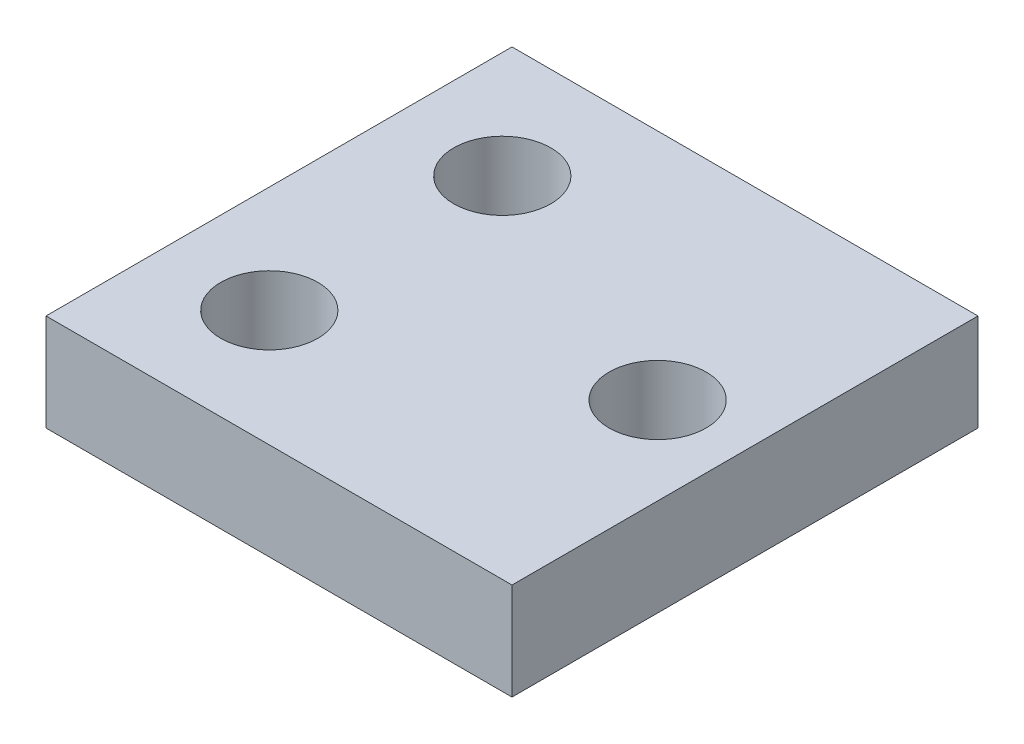
ISO-10303-21;
HEADER;
FILE_DESCRIPTION(('STEP AP214'),'2;1');
FILE_NAME('part.step','',(''),(''),'','','');
FILE_SCHEMA(('AUTOMOTIVE_DESIGN { 1 0 10303 214 1 1 1 1 }'));
ENDSEC;
DATA;
#1=APPLICATION_CONTEXT('core data for automotive mechanical design processes');
#2=APPLICATION_PROTOCOL_DEFINITION('international standard','automotive_design',2000,#1);
#3=PRODUCT_CONTEXT('',#1,'mechanical');
#4=PRODUCT('Part','Part','',(#3));
#5=PRODUCT_RELATED_PRODUCT_CATEGORY('part','',(#4));
#6=PRODUCT_DEFINITION_FORMATION('','',#4);
#7=PRODUCT_DEFINITION_CONTEXT('part definition',#1,'design');
#8=PRODUCT_DEFINITION('design','',#6,#7);
#9=PRODUCT_DEFINITION_SHAPE('','',#8);
#10=(LENGTH_UNIT() NAMED_UNIT(*) SI_UNIT(.MILLI.,.METRE.));
#11=(NAMED_UNIT(*) PLANE_ANGLE_UNIT() SI_UNIT($,.RADIAN.));
#12=(NAMED_UNIT(*) SI_UNIT($,.STERADIAN.) SOLID_ANGLE_UNIT());
#13=UNCERTAINTY_MEASURE_WITH_UNIT(LENGTH_MEASURE(1.E-05),#10,'distance_accuracy_value','');
#14=(GEOMETRIC_REPRESENTATION_CONTEXT(3) GLOBAL_UNCERTAINTY_ASSIGNED_CONTEXT((#13)) GLOBAL_UNIT_ASSIGNED_CONTEXT((#10,
#11,#12)) REPRESENTATION_CONTEXT('',''));
#15=CARTESIAN_POINT('',(0.,0.,0.));
#16=DIRECTION('',(0.,0.,1.));
#17=DIRECTION('',(1.,0.,0.));
#18=AXIS2_PLACEMENT_3D('',#15,#16,#17);
#19=CARTESIAN_POINT('',(-15.24,3.175,-15.24));
#20=DIRECTION('',(1.,0.,0.));
#21=DIRECTION('',(0.,0.,-1.));
#22=AXIS2_PLACEMENT_3D('',#19,#20,#21);
#23=PLANE('',#22);
#24=DIRECTION('',(0.,0.,1.));
#25=VECTOR('',#24,1.);
#26=CARTESIAN_POINT('',(-15.24,-3.175,-15.24));
#27=LINE('',#26,#25);
#28=CARTESIAN_POINT('',(-15.24,-3.175,-15.24));
#29=VERTEX_POINT('',#28);
#30=CARTESIAN_POINT('',(-15.24,-3.175,15.24));
#31=VERTEX_POINT('',#30);
#32=EDGE_CURVE('E96',#29,#31,#27,.T.);
#33=ORIENTED_EDGE('',*,*,#32,.T.);
#34=DIRECTION('',(0.,-1.,0.));
#35=VECTOR('',#34,1.);
#36=CARTESIAN_POINT('',(-15.24,3.175,15.24));
#37=LINE('',#36,#35);
#38=CARTESIAN_POINT('',(-15.24,3.175,15.24));
#39=VERTEX_POINT('',#38);
#40=EDGE_CURVE('E11',#39,#31,#37,.T.);
#41=ORIENTED_EDGE('',*,*,#40,.F.);
#42=DIRECTION('',(0.,0.,1.));
#43=VECTOR('',#42,1.);
#44=CARTESIAN_POINT('',(-15.24,3.175,-15.24));
#45=LINE('',#44,#43);
#46=CARTESIAN_POINT('',(-15.24,3.175,-15.24));
#47=VERTEX_POINT('',#46);
#48=EDGE_CURVE('E84',#47,#39,#45,.T.);
#49=ORIENTED_EDGE('',*,*,#48,.F.);
#50=DIRECTION('',(0.,-1.,0.));
#51=VECTOR('',#50,1.);
#52=CARTESIAN_POINT('',(-15.24,3.175,-15.24));
#53=LINE('',#52,#51);
#54=EDGE_CURVE('E92',#47,#29,#53,.T.);
#55=ORIENTED_EDGE('',*,*,#54,.T.);
#56=EDGE_LOOP('',(#33,#41,#49,#55));
#57=FACE_BOUND('',#56,.T.);
#58=ADVANCED_FACE('F33',(#57),#23,.F.);
#59=CARTESIAN_POINT('',(-15.24,3.175,15.24));
#60=DIRECTION('',(0.,0.,-1.));
#61=DIRECTION('',(-1.,0.,0.));
#62=AXIS2_PLACEMENT_3D('',#59,#60,#61);
#63=PLANE('',#62);
#64=DIRECTION('',(1.,0.,0.));
#65=VECTOR('',#64,1.);
#66=CARTESIAN_POINT('',(-15.24,-3.175,15.24));
#67=LINE('',#66,#65);
#68=CARTESIAN_POINT('',(15.24,-3.175,15.24));
#69=VERTEX_POINT('',#68);
#70=EDGE_CURVE('E88',#31,#69,#67,.T.);
#71=ORIENTED_EDGE('',*,*,#70,.T.);
#72=DIRECTION('',(0.,-1.,0.));
#73=VECTOR('',#72,1.);
#74=CARTESIAN_POINT('',(15.24,3.175,15.24));
#75=LINE('',#74,#73);
#76=CARTESIAN_POINT('',(15.24,3.175,15.24));
#77=VERTEX_POINT('',#76);
#78=EDGE_CURVE('E41',#77,#69,#75,.T.);
#79=ORIENTED_EDGE('',*,*,#78,.F.);
#80=DIRECTION('',(1.,0.,0.));
#81=VECTOR('',#80,1.);
#82=CARTESIAN_POINT('',(-15.24,3.175,15.24));
#83=LINE('',#82,#81);
#84=EDGE_CURVE('E79',#39,#77,#83,.T.);
#85=ORIENTED_EDGE('',*,*,#84,.F.);
#86=ORIENTED_EDGE('',*,*,#40,.T.);
#87=EDGE_LOOP('',(#71,#79,#85,#86));
#88=FACE_BOUND('',#87,.T.);
#89=ADVANCED_FACE('F87',(#88),#63,.F.);
#90=CARTESIAN_POINT('',(15.24,3.175,-15.24));
#91=DIRECTION('',(-1.,0.,0.));
#92=DIRECTION('',(0.,0.,1.));
#93=AXIS2_PLACEMENT_3D('',#90,#91,#92);
#94=PLANE('',#93);
#95=DIRECTION('',(0.,0.,-1.));
#96=VECTOR('',#95,1.);
#97=CARTESIAN_POINT('',(15.24,-3.175,-15.24));
#98=LINE('',#97,#96);
#99=CARTESIAN_POINT('',(15.24,-3.175,-15.24));
#100=VERTEX_POINT('',#99);
#101=EDGE_CURVE('E66',#69,#100,#98,.T.);
#102=ORIENTED_EDGE('',*,*,#101,.T.);
#103=DIRECTION('',(0.,-1.,0.));
#104=VECTOR('',#103,1.);
#105=CARTESIAN_POINT('',(15.24,3.175,-15.24));
#106=LINE('',#105,#104);
#107=CARTESIAN_POINT('',(15.24,3.175,-15.24));
#108=VERTEX_POINT('',#107);
#109=EDGE_CURVE('E89',#108,#100,#106,.T.);
#110=ORIENTED_EDGE('',*,*,#109,.F.);
#111=DIRECTION('',(0.,0.,-1.));
#112=VECTOR('',#111,1.);
#113=CARTESIAN_POINT('',(15.24,3.175,-15.24));
#114=LINE('',#113,#112);
#115=EDGE_CURVE('E82',#77,#108,#114,.T.);
#116=ORIENTED_EDGE('',*,*,#115,.F.);
#117=ORIENTED_EDGE('',*,*,#78,.T.);
#118=EDGE_LOOP('',(#102,#110,#116,#117));
#119=FACE_BOUND('',#118,.T.);
#120=ADVANCED_FACE('F90',(#119),#94,.F.);
#121=CARTESIAN_POINT('',(-15.24,3.175,-15.24));
#122=DIRECTION('',(0.,0.,1.));
#123=DIRECTION('',(1.,0.,0.));
#124=AXIS2_PLACEMENT_3D('',#121,#122,#123);
#125=PLANE('',#124);
#126=DIRECTION('',(-1.,0.,0.));
#127=VECTOR('',#126,1.);
#128=CARTESIAN_POINT('',(-15.24,-3.175,-15.24));
#129=LINE('',#128,#127);
#130=EDGE_CURVE('E72',#100,#29,#129,.T.);
#131=ORIENTED_EDGE('',*,*,#130,.T.);
#132=ORIENTED_EDGE('',*,*,#54,.F.);
#133=DIRECTION('',(-1.,0.,0.));
#134=VECTOR('',#133,1.);
#135=CARTESIAN_POINT('',(-15.24,3.175,-15.24));
#136=LINE('',#135,#134);
#137=EDGE_CURVE('E49',#108,#47,#136,.T.);
#138=ORIENTED_EDGE('',*,*,#137,.F.);
#139=ORIENTED_EDGE('',*,*,#109,.T.);
#140=EDGE_LOOP('',(#131,#132,#138,#139));
#141=FACE_BOUND('',#140,.T.);
#142=ADVANCED_FACE('F104',(#141),#125,.F.);
#143=CARTESIAN_POINT('',(0.,3.175,0.));
#144=DIRECTION('',(0.,1.,0.));
#145=DIRECTION('',(0.,0.,1.));
#146=AXIS2_PLACEMENT_3D('',#143,#144,#145);
#147=PLANE('',#146);
#148=CARTESIAN_POINT('',(-8.255,3.175,-7.62));
#149=DIRECTION('',(0.,1.,0.));
#150=DIRECTION('',(0.,0.,1.));
#151=AXIS2_PLACEMENT_3D('',#148,#149,#150);
#152=CIRCLE('',#151,3.175);
#153=CARTESIAN_POINT('',(-8.255,3.175,-4.445));
#154=VERTEX_POINT('',#153);
#155=EDGE_CURVE('E124',#154,#154,#152,.T.);
#156=ORIENTED_EDGE('',*,*,#155,.F.);
#157=EDGE_LOOP('',(#156));
#158=FACE_BOUND('',#157,.T.);
#159=CARTESIAN_POINT('',(-8.255,3.175,7.62));
#160=DIRECTION('',(0.,1.,0.));
#161=DIRECTION('',(0.,0.,1.));
#162=AXIS2_PLACEMENT_3D('',#159,#160,#161);
#163=CIRCLE('',#162,3.175);
#164=CARTESIAN_POINT('',(-8.255,3.175,10.795));
#165=VERTEX_POINT('',#164);
#166=EDGE_CURVE('E118',#165,#165,#163,.T.);
#167=ORIENTED_EDGE('',*,*,#166,.F.);
#168=EDGE_LOOP('',(#167));
#169=FACE_BOUND('',#168,.T.);
#170=CARTESIAN_POINT('',(9.525,3.175,0.));
#171=DIRECTION('',(0.,1.,0.));
#172=DIRECTION('',(0.,0.,1.));
#173=AXIS2_PLACEMENT_3D('',#170,#171,#172);
#174=CIRCLE('',#173,3.175);
#175=CARTESIAN_POINT('',(9.525,3.175,3.175));
#176=VERTEX_POINT('',#175);
#177=EDGE_CURVE('E112',#176,#176,#174,.T.);
#178=ORIENTED_EDGE('',*,*,#177,.F.);
#179=EDGE_LOOP('',(#178));
#180=FACE_BOUND('',#179,.T.);
#181=ORIENTED_EDGE('',*,*,#48,.T.);
#182=ORIENTED_EDGE('',*,*,#84,.T.);
#183=ORIENTED_EDGE('',*,*,#115,.T.);
#184=ORIENTED_EDGE('',*,*,#137,.T.);
#185=EDGE_LOOP('',(#181,#182,#183,#184));
#186=FACE_BOUND('',#185,.T.);
#187=ADVANCED_FACE('F80',(#158,#169,#180,#186),#147,.T.);
#188=CARTESIAN_POINT('',(0.,-3.175,0.));
#189=DIRECTION('',(0.,1.,0.));
#190=DIRECTION('',(0.,0.,1.));
#191=AXIS2_PLACEMENT_3D('',#188,#189,#190);
#192=PLANE('',#191);
#193=CARTESIAN_POINT('',(-8.255,-3.175,-7.62));
#194=DIRECTION('',(0.,1.,0.));
#195=DIRECTION('',(0.,0.,1.));
#196=AXIS2_PLACEMENT_3D('',#193,#194,#195);
#197=CIRCLE('',#196,3.175);
#198=CARTESIAN_POINT('',(-8.255,-3.175,-4.445));
#199=VERTEX_POINT('',#198);
#200=EDGE_CURVE('E121',#199,#199,#197,.F.);
#201=ORIENTED_EDGE('',*,*,#200,.F.);
#202=EDGE_LOOP('',(#201));
#203=FACE_BOUND('',#202,.T.);
#204=CARTESIAN_POINT('',(-8.255,-3.175,7.62));
#205=DIRECTION('',(0.,1.,0.));
#206=DIRECTION('',(0.,0.,1.));
#207=AXIS2_PLACEMENT_3D('',#204,#205,#206);
#208=CIRCLE('',#207,3.175);
#209=CARTESIAN_POINT('',(-8.255,-3.175,10.795));
#210=VERTEX_POINT('',#209);
#211=EDGE_CURVE('E115',#210,#210,#208,.F.);
#212=ORIENTED_EDGE('',*,*,#211,.F.);
#213=EDGE_LOOP('',(#212));
#214=FACE_BOUND('',#213,.T.);
#215=CARTESIAN_POINT('',(9.525,-3.175,0.));
#216=DIRECTION('',(0.,1.,0.));
#217=DIRECTION('',(0.,0.,1.));
#218=AXIS2_PLACEMENT_3D('',#215,#216,#217);
#219=CIRCLE('',#218,3.175);
#220=CARTESIAN_POINT('',(9.525,-3.175,3.175));
#221=VERTEX_POINT('',#220);
#222=EDGE_CURVE('E99',#221,#221,#219,.F.);
#223=ORIENTED_EDGE('',*,*,#222,.F.);
#224=EDGE_LOOP('',(#223));
#225=FACE_BOUND('',#224,.T.);
#226=ORIENTED_EDGE('',*,*,#32,.F.);
#227=ORIENTED_EDGE('',*,*,#130,.F.);
#228=ORIENTED_EDGE('',*,*,#101,.F.);
#229=ORIENTED_EDGE('',*,*,#70,.F.);
#230=EDGE_LOOP('',(#226,#227,#228,#229));
#231=FACE_BOUND('',#230,.T.);
#232=ADVANCED_FACE('F107',(#203,#214,#225,#231),#192,.F.);
#233=CARTESIAN_POINT('',(9.525,-3.176,0.));
#234=DIRECTION('',(0.,1.,0.));
#235=DIRECTION('',(0.,0.,1.));
#236=AXIS2_PLACEMENT_3D('',#233,#234,#235);
#237=CYLINDRICAL_SURFACE('',#236,3.175);
#238=ORIENTED_EDGE('',*,*,#177,.T.);
#239=EDGE_LOOP('',(#238));
#240=FACE_BOUND('',#239,.T.);
#241=ORIENTED_EDGE('',*,*,#222,.T.);
#242=EDGE_LOOP('',(#241));
#243=FACE_BOUND('',#242,.T.);
#244=ADVANCED_FACE('F138',(#240,#243),#237,.F.);
#245=CARTESIAN_POINT('',(-8.255,-3.176,7.62));
#246=DIRECTION('',(0.,1.,0.));
#247=DIRECTION('',(0.,0.,1.));
#248=AXIS2_PLACEMENT_3D('',#245,#246,#247);
#249=CYLINDRICAL_SURFACE('',#248,3.175);
#250=ORIENTED_EDGE('',*,*,#166,.T.);
#251=EDGE_LOOP('',(#250));
#252=FACE_BOUND('',#251,.T.);
#253=ORIENTED_EDGE('',*,*,#211,.T.);
#254=EDGE_LOOP('',(#253));
#255=FACE_BOUND('',#254,.T.);
#256=ADVANCED_FACE('F141',(#252,#255),#249,.F.);
#257=CARTESIAN_POINT('',(-8.255,-3.176,-7.62));
#258=DIRECTION('',(0.,1.,0.));
#259=DIRECTION('',(0.,0.,1.));
#260=AXIS2_PLACEMENT_3D('',#257,#258,#259);
#261=CYLINDRICAL_SURFACE('',#260,3.175);
#262=ORIENTED_EDGE('',*,*,#155,.T.);
#263=EDGE_LOOP('',(#262));
#264=FACE_BOUND('',#263,.T.);
#265=ORIENTED_EDGE('',*,*,#200,.T.);
#266=EDGE_LOOP('',(#265));
#267=FACE_BOUND('',#266,.T.);
#268=ADVANCED_FACE('F128',(#264,#267),#261,.F.);
#269=CLOSED_SHELL('',(#58,#89,#120,#142,#187,#232,#244,#256,#268));
#270=MANIFOLD_SOLID_BREP('B2',#269);
#271=ADVANCED_BREP_SHAPE_REPRESENTATION('',(#18,#270),#14);
#272=SHAPE_DEFINITION_REPRESENTATION(#9,#271);
ENDSEC;
END-ISO-10303-21;
